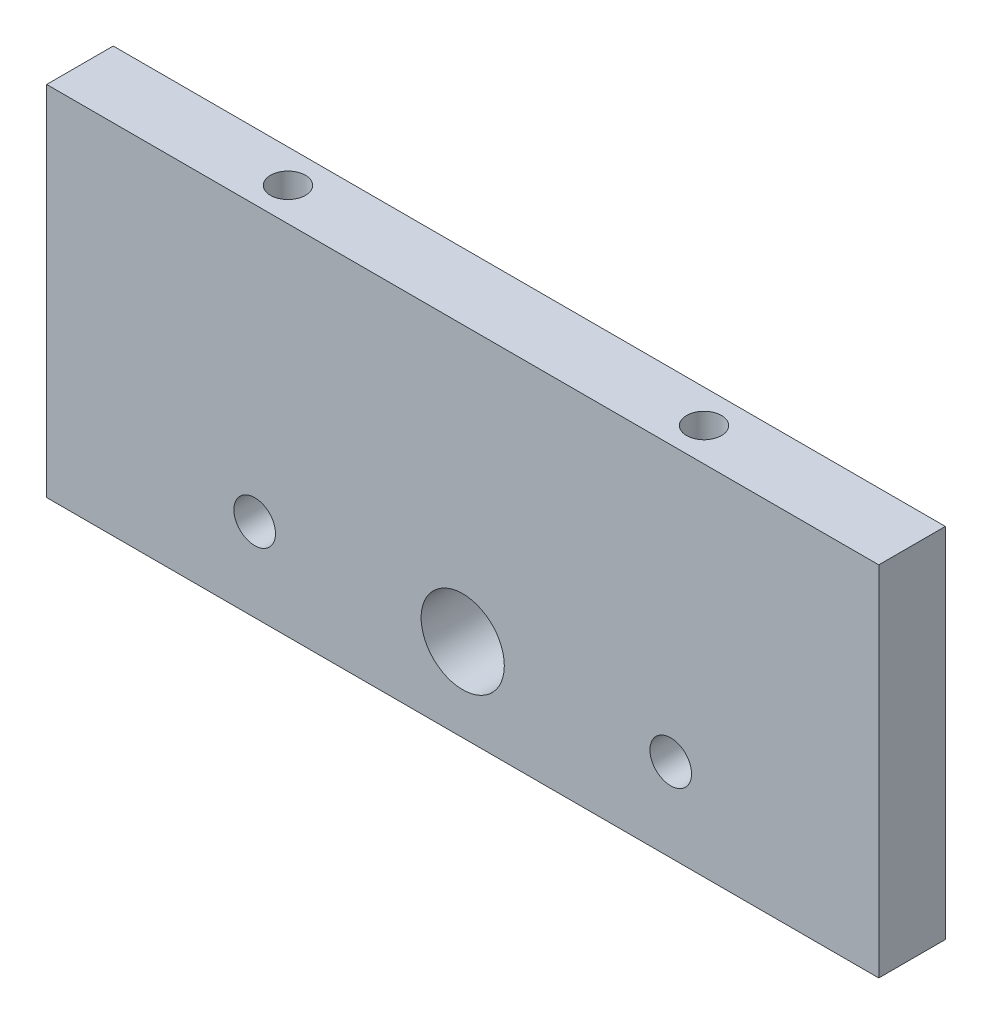
ISO-10303-21;
HEADER;
FILE_DESCRIPTION(('STEP AP214'),'2;1');
FILE_NAME('part.step','',(''),(''),'','','');
FILE_SCHEMA(('AUTOMOTIVE_DESIGN { 1 0 10303 214 1 1 1 1 }'));
ENDSEC;
DATA;
#1=APPLICATION_CONTEXT('core data for automotive mechanical design processes');
#2=APPLICATION_PROTOCOL_DEFINITION('international standard','automotive_design',2000,#1);
#3=PRODUCT_CONTEXT('',#1,'mechanical');
#4=PRODUCT('Part','Part','',(#3));
#5=PRODUCT_RELATED_PRODUCT_CATEGORY('part','',(#4));
#6=PRODUCT_DEFINITION_FORMATION('','',#4);
#7=PRODUCT_DEFINITION_CONTEXT('part definition',#1,'design');
#8=PRODUCT_DEFINITION('design','',#6,#7);
#9=PRODUCT_DEFINITION_SHAPE('','',#8);
#10=(LENGTH_UNIT() NAMED_UNIT(*) SI_UNIT(.MILLI.,.METRE.));
#11=(NAMED_UNIT(*) PLANE_ANGLE_UNIT() SI_UNIT($,.RADIAN.));
#12=(NAMED_UNIT(*) SI_UNIT($,.STERADIAN.) SOLID_ANGLE_UNIT());
#13=UNCERTAINTY_MEASURE_WITH_UNIT(LENGTH_MEASURE(1.E-05),#10,'distance_accuracy_value','');
#14=(GEOMETRIC_REPRESENTATION_CONTEXT(3) GLOBAL_UNCERTAINTY_ASSIGNED_CONTEXT((#13)) GLOBAL_UNIT_ASSIGNED_CONTEXT((#10,
#11,#12)) REPRESENTATION_CONTEXT('',''));
#15=CARTESIAN_POINT('',(0.,0.,0.));
#16=DIRECTION('',(0.,0.,1.));
#17=DIRECTION('',(1.,0.,0.));
#18=AXIS2_PLACEMENT_3D('',#15,#16,#17);
#19=CARTESIAN_POINT('',(0.,0.,8.));
#20=DIRECTION('',(1.,0.,0.));
#21=DIRECTION('',(0.,0.,-1.));
#22=AXIS2_PLACEMENT_3D('',#19,#20,#21);
#23=PLANE('',#22);
#24=DIRECTION('',(0.,-1.,0.));
#25=VECTOR('',#24,1.);
#26=CARTESIAN_POINT('',(0.,0.,0.));
#27=LINE('',#26,#25);
#28=CARTESIAN_POINT('',(0.,43.,0.));
#29=VERTEX_POINT('',#28);
#30=CARTESIAN_POINT('',(0.,0.,0.));
#31=VERTEX_POINT('',#30);
#32=EDGE_CURVE('E128',#29,#31,#27,.T.);
#33=ORIENTED_EDGE('',*,*,#32,.T.);
#34=DIRECTION('',(0.,0.,-1.));
#35=VECTOR('',#34,1.);
#36=CARTESIAN_POINT('',(0.,0.,8.));
#37=LINE('',#36,#35);
#38=CARTESIAN_POINT('',(0.,0.,8.));
#39=VERTEX_POINT('',#38);
#40=EDGE_CURVE('E11',#39,#31,#37,.T.);
#41=ORIENTED_EDGE('',*,*,#40,.F.);
#42=DIRECTION('',(0.,-1.,0.));
#43=VECTOR('',#42,1.);
#44=CARTESIAN_POINT('',(0.,0.,8.));
#45=LINE('',#44,#43);
#46=CARTESIAN_POINT('',(0.,43.,8.));
#47=VERTEX_POINT('',#46);
#48=EDGE_CURVE('E131',#47,#39,#45,.T.);
#49=ORIENTED_EDGE('',*,*,#48,.F.);
#50=DIRECTION('',(0.,0.,-1.));
#51=VECTOR('',#50,1.);
#52=CARTESIAN_POINT('',(0.,43.,8.));
#53=LINE('',#52,#51);
#54=EDGE_CURVE('E137',#47,#29,#53,.T.);
#55=ORIENTED_EDGE('',*,*,#54,.T.);
#56=EDGE_LOOP('',(#33,#41,#49,#55));
#57=FACE_BOUND('',#56,.T.);
#58=ADVANCED_FACE('F39',(#57),#23,.F.);
#59=CARTESIAN_POINT('',(0.,0.,8.));
#60=DIRECTION('',(0.,1.,0.));
#61=DIRECTION('',(0.,0.,1.));
#62=AXIS2_PLACEMENT_3D('',#59,#60,#61);
#63=PLANE('',#62);
#64=DIRECTION('',(1.,0.,0.));
#65=VECTOR('',#64,1.);
#66=CARTESIAN_POINT('',(0.,0.,0.));
#67=LINE('',#66,#65);
#68=CARTESIAN_POINT('',(100.,0.,0.));
#69=VERTEX_POINT('',#68);
#70=EDGE_CURVE('E140',#31,#69,#67,.T.);
#71=ORIENTED_EDGE('',*,*,#70,.T.);
#72=DIRECTION('',(0.,0.,-1.));
#73=VECTOR('',#72,1.);
#74=CARTESIAN_POINT('',(100.,0.,8.));
#75=LINE('',#74,#73);
#76=CARTESIAN_POINT('',(100.,0.,8.));
#77=VERTEX_POINT('',#76);
#78=EDGE_CURVE('E48',#77,#69,#75,.T.);
#79=ORIENTED_EDGE('',*,*,#78,.F.);
#80=DIRECTION('',(1.,0.,0.));
#81=VECTOR('',#80,1.);
#82=CARTESIAN_POINT('',(0.,0.,8.));
#83=LINE('',#82,#81);
#84=EDGE_CURVE('E87',#39,#77,#83,.T.);
#85=ORIENTED_EDGE('',*,*,#84,.F.);
#86=ORIENTED_EDGE('',*,*,#40,.T.);
#87=EDGE_LOOP('',(#71,#79,#85,#86));
#88=FACE_BOUND('',#87,.T.);
#89=ADVANCED_FACE('F168',(#88),#63,.F.);
#90=CARTESIAN_POINT('',(100.,0.,8.));
#91=DIRECTION('',(-1.,0.,0.));
#92=DIRECTION('',(0.,0.,1.));
#93=AXIS2_PLACEMENT_3D('',#90,#91,#92);
#94=PLANE('',#93);
#95=DIRECTION('',(0.,1.,0.));
#96=VECTOR('',#95,1.);
#97=CARTESIAN_POINT('',(100.,0.,0.));
#98=LINE('',#97,#96);
#99=CARTESIAN_POINT('',(100.,43.,0.));
#100=VERTEX_POINT('',#99);
#101=EDGE_CURVE('E74',#69,#100,#98,.T.);
#102=ORIENTED_EDGE('',*,*,#101,.T.);
#103=DIRECTION('',(0.,0.,-1.));
#104=VECTOR('',#103,1.);
#105=CARTESIAN_POINT('',(100.,43.,8.));
#106=LINE('',#105,#104);
#107=CARTESIAN_POINT('',(100.,43.,8.));
#108=VERTEX_POINT('',#107);
#109=EDGE_CURVE('E145',#108,#100,#106,.T.);
#110=ORIENTED_EDGE('',*,*,#109,.F.);
#111=DIRECTION('',(0.,1.,0.));
#112=VECTOR('',#111,1.);
#113=CARTESIAN_POINT('',(100.,0.,8.));
#114=LINE('',#113,#112);
#115=EDGE_CURVE('E134',#77,#108,#114,.T.);
#116=ORIENTED_EDGE('',*,*,#115,.F.);
#117=ORIENTED_EDGE('',*,*,#78,.T.);
#118=EDGE_LOOP('',(#102,#110,#116,#117));
#119=FACE_BOUND('',#118,.T.);
#120=ADVANCED_FACE('F148',(#119),#94,.F.);
#121=CARTESIAN_POINT('',(0.,43.,8.));
#122=DIRECTION('',(0.,-1.,0.));
#123=DIRECTION('',(0.,0.,-1.));
#124=AXIS2_PLACEMENT_3D('',#121,#122,#123);
#125=PLANE('',#124);
#126=CARTESIAN_POINT('',(25.,43.,4.00000000000001));
#127=DIRECTION('',(0.,1.,0.));
#128=DIRECTION('',(0.,0.,1.));
#129=AXIS2_PLACEMENT_3D('',#126,#127,#128);
#130=CIRCLE('',#129,2.1);
#131=CARTESIAN_POINT('',(25.,43.,6.1));
#132=VERTEX_POINT('',#131);
#133=EDGE_CURVE('E105',#132,#132,#130,.T.);
#134=ORIENTED_EDGE('',*,*,#133,.F.);
#135=EDGE_LOOP('',(#134));
#136=FACE_BOUND('',#135,.T.);
#137=CARTESIAN_POINT('',(75.,43.,4.));
#138=DIRECTION('',(0.,1.,0.));
#139=DIRECTION('',(0.,0.,1.));
#140=AXIS2_PLACEMENT_3D('',#137,#138,#139);
#141=CIRCLE('',#140,2.1);
#142=CARTESIAN_POINT('',(75.,43.,6.1));
#143=VERTEX_POINT('',#142);
#144=EDGE_CURVE('E104',#143,#143,#141,.T.);
#145=ORIENTED_EDGE('',*,*,#144,.F.);
#146=EDGE_LOOP('',(#145));
#147=FACE_BOUND('',#146,.T.);
#148=DIRECTION('',(-1.,0.,0.));
#149=VECTOR('',#148,1.);
#150=CARTESIAN_POINT('',(0.,43.,0.));
#151=LINE('',#150,#149);
#152=EDGE_CURVE('E80',#100,#29,#151,.T.);
#153=ORIENTED_EDGE('',*,*,#152,.T.);
#154=ORIENTED_EDGE('',*,*,#54,.F.);
#155=DIRECTION('',(-1.,0.,0.));
#156=VECTOR('',#155,1.);
#157=CARTESIAN_POINT('',(0.,43.,8.));
#158=LINE('',#157,#156);
#159=EDGE_CURVE('E56',#108,#47,#158,.T.);
#160=ORIENTED_EDGE('',*,*,#159,.F.);
#161=ORIENTED_EDGE('',*,*,#109,.T.);
#162=EDGE_LOOP('',(#153,#154,#160,#161));
#163=FACE_BOUND('',#162,.T.);
#164=ADVANCED_FACE('F155',(#136,#147,#163),#125,.F.);
#165=CARTESIAN_POINT('',(0.,0.,8.));
#166=DIRECTION('',(0.,0.,-1.));
#167=DIRECTION('',(-1.,0.,0.));
#168=AXIS2_PLACEMENT_3D('',#165,#166,#167);
#169=PLANE('',#168);
#170=CARTESIAN_POINT('',(25.,10.,8.));
#171=DIRECTION('',(0.,0.,1.));
#172=DIRECTION('',(1.,0.,0.));
#173=AXIS2_PLACEMENT_3D('',#170,#171,#172);
#174=CIRCLE('',#173,2.49999999999999);
#175=CARTESIAN_POINT('',(27.5,10.,8.));
#176=VERTEX_POINT('',#175);
#177=EDGE_CURVE('E115',#176,#176,#174,.T.);
#178=ORIENTED_EDGE('',*,*,#177,.F.);
#179=EDGE_LOOP('',(#178));
#180=FACE_BOUND('',#179,.T.);
#181=CARTESIAN_POINT('',(75.,10.,8.));
#182=DIRECTION('',(0.,0.,1.));
#183=DIRECTION('',(1.,0.,0.));
#184=AXIS2_PLACEMENT_3D('',#181,#182,#183);
#185=CIRCLE('',#184,2.49999999999999);
#186=CARTESIAN_POINT('',(77.5,10.,8.));
#187=VERTEX_POINT('',#186);
#188=EDGE_CURVE('E118',#187,#187,#185,.T.);
#189=ORIENTED_EDGE('',*,*,#188,.F.);
#190=EDGE_LOOP('',(#189));
#191=FACE_BOUND('',#190,.T.);
#192=CARTESIAN_POINT('',(50.,10.,8.));
#193=DIRECTION('',(0.,0.,1.));
#194=DIRECTION('',(1.,0.,0.));
#195=AXIS2_PLACEMENT_3D('',#192,#193,#194);
#196=CIRCLE('',#195,5.);
#197=CARTESIAN_POINT('',(55.,10.,8.));
#198=VERTEX_POINT('',#197);
#199=EDGE_CURVE('E124',#198,#198,#196,.T.);
#200=ORIENTED_EDGE('',*,*,#199,.F.);
#201=EDGE_LOOP('',(#200));
#202=FACE_BOUND('',#201,.T.);
#203=ORIENTED_EDGE('',*,*,#48,.T.);
#204=ORIENTED_EDGE('',*,*,#84,.T.);
#205=ORIENTED_EDGE('',*,*,#115,.T.);
#206=ORIENTED_EDGE('',*,*,#159,.T.);
#207=EDGE_LOOP('',(#203,#204,#205,#206));
#208=FACE_BOUND('',#207,.T.);
#209=ADVANCED_FACE('F157',(#180,#191,#202,#208),#169,.F.);
#210=CARTESIAN_POINT('',(0.,0.,0.));
#211=DIRECTION('',(0.,0.,-1.));
#212=DIRECTION('',(-1.,0.,0.));
#213=AXIS2_PLACEMENT_3D('',#210,#211,#212);
#214=PLANE('',#213);
#215=CARTESIAN_POINT('',(25.,10.,0.));
#216=DIRECTION('',(0.,0.,-1.));
#217=DIRECTION('',(-1.,0.,0.));
#218=AXIS2_PLACEMENT_3D('',#215,#216,#217);
#219=CIRCLE('',#218,2.49999999999999);
#220=CARTESIAN_POINT('',(22.5,10.,0.));
#221=VERTEX_POINT('',#220);
#222=EDGE_CURVE('E42',#221,#221,#219,.T.);
#223=ORIENTED_EDGE('',*,*,#222,.F.);
#224=EDGE_LOOP('',(#223));
#225=FACE_BOUND('',#224,.T.);
#226=CARTESIAN_POINT('',(75.,10.,0.));
#227=DIRECTION('',(0.,0.,-1.));
#228=DIRECTION('',(-1.,0.,0.));
#229=AXIS2_PLACEMENT_3D('',#226,#227,#228);
#230=CIRCLE('',#229,2.5);
#231=CARTESIAN_POINT('',(72.5,10.,0.));
#232=VERTEX_POINT('',#231);
#233=EDGE_CURVE('E121',#232,#232,#230,.T.);
#234=ORIENTED_EDGE('',*,*,#233,.F.);
#235=EDGE_LOOP('',(#234));
#236=FACE_BOUND('',#235,.T.);
#237=CARTESIAN_POINT('',(50.,10.,0.));
#238=DIRECTION('',(0.,0.,1.));
#239=DIRECTION('',(1.,0.,0.));
#240=AXIS2_PLACEMENT_3D('',#237,#238,#239);
#241=CIRCLE('',#240,5.);
#242=CARTESIAN_POINT('',(55.,10.,0.));
#243=VERTEX_POINT('',#242);
#244=EDGE_CURVE('E125',#243,#243,#241,.T.);
#245=ORIENTED_EDGE('',*,*,#244,.T.);
#246=EDGE_LOOP('',(#245));
#247=FACE_BOUND('',#246,.T.);
#248=ORIENTED_EDGE('',*,*,#32,.F.);
#249=ORIENTED_EDGE('',*,*,#152,.F.);
#250=ORIENTED_EDGE('',*,*,#101,.F.);
#251=ORIENTED_EDGE('',*,*,#70,.F.);
#252=EDGE_LOOP('',(#248,#249,#250,#251));
#253=FACE_BOUND('',#252,.T.);
#254=ADVANCED_FACE('F151',(#225,#236,#247,#253),#214,.T.);
#255=CARTESIAN_POINT('',(50.,10.,0.));
#256=DIRECTION('',(0.,0.,1.));
#257=DIRECTION('',(1.,0.,0.));
#258=AXIS2_PLACEMENT_3D('',#255,#256,#257);
#259=CYLINDRICAL_SURFACE('',#258,5.);
#260=ORIENTED_EDGE('',*,*,#244,.F.);
#261=EDGE_LOOP('',(#260));
#262=FACE_BOUND('',#261,.T.);
#263=ORIENTED_EDGE('',*,*,#199,.T.);
#264=EDGE_LOOP('',(#263));
#265=FACE_BOUND('',#264,.T.);
#266=ADVANCED_FACE('F198',(#262,#265),#259,.F.);
#267=CARTESIAN_POINT('',(75.,10.,8.));
#268=DIRECTION('',(0.,0.,1.));
#269=DIRECTION('',(1.,0.,0.));
#270=AXIS2_PLACEMENT_3D('',#267,#268,#269);
#271=CYLINDRICAL_SURFACE('',#270,2.5);
#272=ORIENTED_EDGE('',*,*,#233,.T.);
#273=EDGE_LOOP('',(#272));
#274=FACE_BOUND('',#273,.T.);
#275=ORIENTED_EDGE('',*,*,#188,.T.);
#276=EDGE_LOOP('',(#275));
#277=FACE_BOUND('',#276,.T.);
#278=ADVANCED_FACE('F205',(#274,#277),#271,.F.);
#279=CARTESIAN_POINT('',(25.,10.,8.));
#280=DIRECTION('',(0.,0.,1.));
#281=DIRECTION('',(1.,0.,0.));
#282=AXIS2_PLACEMENT_3D('',#279,#280,#281);
#283=CYLINDRICAL_SURFACE('',#282,2.49999999999999);
#284=ORIENTED_EDGE('',*,*,#222,.T.);
#285=EDGE_LOOP('',(#284));
#286=FACE_BOUND('',#285,.T.);
#287=ORIENTED_EDGE('',*,*,#177,.T.);
#288=EDGE_LOOP('',(#287));
#289=FACE_BOUND('',#288,.T.);
#290=ADVANCED_FACE('F213',(#286,#289),#283,.F.);
#291=CARTESIAN_POINT('',(75.,30.6,4.));
#292=DIRECTION('',(0.,1.,0.));
#293=DIRECTION('',(0.,0.,1.));
#294=AXIS2_PLACEMENT_3D('',#291,#292,#293);
#295=CONICAL_SURFACE('',#294,2.1,1.02974425867666);
#296=CARTESIAN_POINT('',(75.,29.3381927000421,4.));
#297=VERTEX_POINT('',#296);
#298=VERTEX_LOOP('',#297);
#299=FACE_BOUND('',#298,.T.);
#300=CARTESIAN_POINT('',(75.,30.6,4.));
#301=DIRECTION('',(0.,1.,0.));
#302=DIRECTION('',(0.,0.,1.));
#303=AXIS2_PLACEMENT_3D('',#300,#301,#302);
#304=CIRCLE('',#303,2.1);
#305=CARTESIAN_POINT('',(75.,30.6,6.1));
#306=VERTEX_POINT('',#305);
#307=EDGE_CURVE('E108',#306,#306,#304,.T.);
#308=ORIENTED_EDGE('',*,*,#307,.T.);
#309=EDGE_LOOP('',(#308));
#310=FACE_BOUND('',#309,.T.);
#311=ADVANCED_FACE('F220',(#299,#310),#295,.F.);
#312=CARTESIAN_POINT('',(75.,43.,4.));
#313=DIRECTION('',(0.,1.,0.));
#314=DIRECTION('',(0.,0.,1.));
#315=AXIS2_PLACEMENT_3D('',#312,#313,#314);
#316=CYLINDRICAL_SURFACE('',#315,2.1);
#317=ORIENTED_EDGE('',*,*,#307,.F.);
#318=EDGE_LOOP('',(#317));
#319=FACE_BOUND('',#318,.T.);
#320=ORIENTED_EDGE('',*,*,#144,.T.);
#321=EDGE_LOOP('',(#320));
#322=FACE_BOUND('',#321,.T.);
#323=ADVANCED_FACE('F98',(#319,#322),#316,.F.);
#324=CARTESIAN_POINT('',(25.,30.6,4.00000000000001));
#325=DIRECTION('',(0.,1.,0.));
#326=DIRECTION('',(0.,0.,1.));
#327=AXIS2_PLACEMENT_3D('',#324,#325,#326);
#328=CONICAL_SURFACE('',#327,2.1,1.02974425867665);
#329=CARTESIAN_POINT('',(25.,29.3381927000421,4.00000000000001));
#330=VERTEX_POINT('',#329);
#331=VERTEX_LOOP('',#330);
#332=FACE_BOUND('',#331,.T.);
#333=CARTESIAN_POINT('',(25.,30.6,4.00000000000001));
#334=DIRECTION('',(0.,1.,0.));
#335=DIRECTION('',(0.,0.,1.));
#336=AXIS2_PLACEMENT_3D('',#333,#334,#335);
#337=CIRCLE('',#336,2.1);
#338=CARTESIAN_POINT('',(25.,30.6,6.1));
#339=VERTEX_POINT('',#338);
#340=EDGE_CURVE('E102',#339,#339,#337,.T.);
#341=ORIENTED_EDGE('',*,*,#340,.T.);
#342=EDGE_LOOP('',(#341));
#343=FACE_BOUND('',#342,.T.);
#344=ADVANCED_FACE('F94',(#332,#343),#328,.F.);
#345=CARTESIAN_POINT('',(25.,43.,4.00000000000001));
#346=DIRECTION('',(0.,1.,0.));
#347=DIRECTION('',(0.,0.,1.));
#348=AXIS2_PLACEMENT_3D('',#345,#346,#347);
#349=CYLINDRICAL_SURFACE('',#348,2.1);
#350=ORIENTED_EDGE('',*,*,#340,.F.);
#351=EDGE_LOOP('',(#350));
#352=FACE_BOUND('',#351,.T.);
#353=ORIENTED_EDGE('',*,*,#133,.T.);
#354=EDGE_LOOP('',(#353));
#355=FACE_BOUND('',#354,.T.);
#356=ADVANCED_FACE('F97',(#352,#355),#349,.F.);
#357=CLOSED_SHELL('',(#58,#89,#120,#164,#209,#254,#266,#278,#290,#311,#323,#344,#356));
#358=MANIFOLD_SOLID_BREP('B2',#357);
#359=ADVANCED_BREP_SHAPE_REPRESENTATION('',(#18,#358),#14);
#360=SHAPE_DEFINITION_REPRESENTATION(#9,#359);
ENDSEC;
END-ISO-10303-21;
